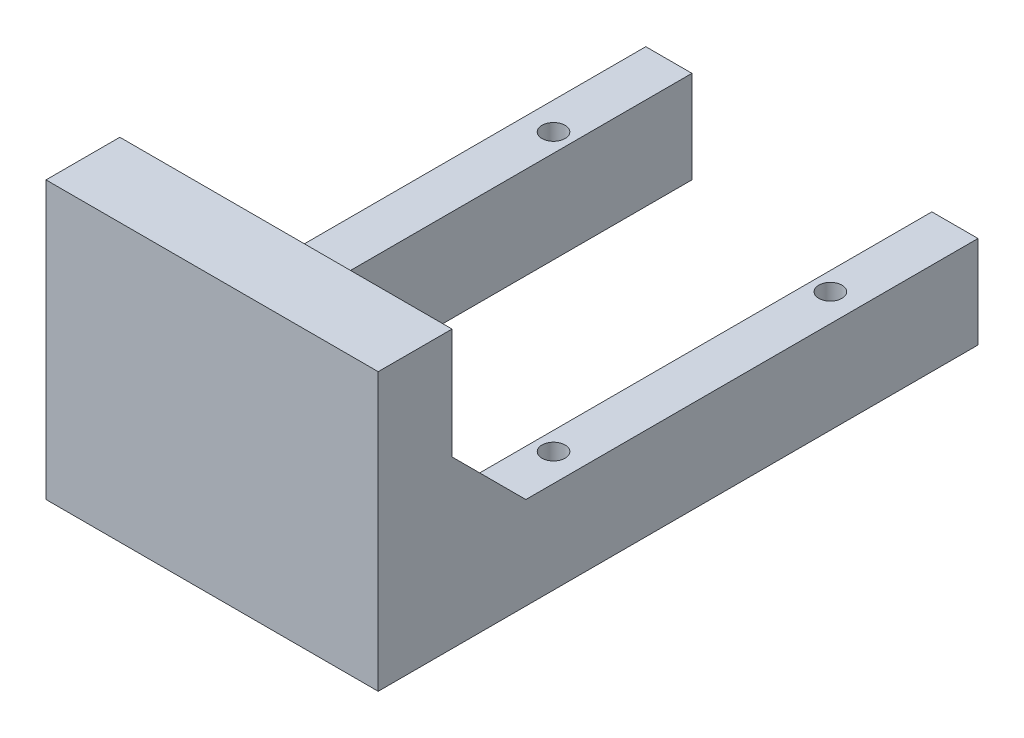
ISO-10303-21;
HEADER;
FILE_DESCRIPTION(('STEP AP214'),'2;1');
FILE_NAME('part.step','',(''),(''),'','','');
FILE_SCHEMA(('AUTOMOTIVE_DESIGN { 1 0 10303 214 1 1 1 1 }'));
ENDSEC;
DATA;
#1=APPLICATION_CONTEXT('core data for automotive mechanical design processes');
#2=APPLICATION_PROTOCOL_DEFINITION('international standard','automotive_design',2000,#1);
#3=PRODUCT_CONTEXT('',#1,'mechanical');
#4=PRODUCT('Part','Part','',(#3));
#5=PRODUCT_RELATED_PRODUCT_CATEGORY('part','',(#4));
#6=PRODUCT_DEFINITION_FORMATION('','',#4);
#7=PRODUCT_DEFINITION_CONTEXT('part definition',#1,'design');
#8=PRODUCT_DEFINITION('design','',#6,#7);
#9=PRODUCT_DEFINITION_SHAPE('','',#8);
#10=(LENGTH_UNIT() NAMED_UNIT(*) SI_UNIT(.MILLI.,.METRE.));
#11=(NAMED_UNIT(*) PLANE_ANGLE_UNIT() SI_UNIT($,.RADIAN.));
#12=(NAMED_UNIT(*) SI_UNIT($,.STERADIAN.) SOLID_ANGLE_UNIT());
#13=UNCERTAINTY_MEASURE_WITH_UNIT(LENGTH_MEASURE(1.E-05),#10,'distance_accuracy_value','');
#14=(GEOMETRIC_REPRESENTATION_CONTEXT(3) GLOBAL_UNCERTAINTY_ASSIGNED_CONTEXT((#13)) GLOBAL_UNIT_ASSIGNED_CONTEXT((#10,
#11,#12)) REPRESENTATION_CONTEXT('',''));
#15=CARTESIAN_POINT('',(0.,0.,0.));
#16=DIRECTION('',(0.,0.,1.));
#17=DIRECTION('',(1.,0.,0.));
#18=AXIS2_PLACEMENT_3D('',#15,#16,#17);
#19=CARTESIAN_POINT('',(0.,0.,0.));
#20=DIRECTION('',(0.,1.,0.));
#21=DIRECTION('',(0.,0.,1.));
#22=AXIS2_PLACEMENT_3D('',#19,#20,#21);
#23=PLANE('',#22);
#24=DIRECTION('',(0.,0.,1.));
#25=VECTOR('',#24,1.);
#26=CARTESIAN_POINT('',(26.,0.,124.));
#27=LINE('',#26,#25);
#28=CARTESIAN_POINT('',(26.,0.,124.));
#29=VERTEX_POINT('',#28);
#30=CARTESIAN_POINT('',(26.,0.,222.));
#31=VERTEX_POINT('',#30);
#32=EDGE_CURVE('E216',#29,#31,#27,.T.);
#33=ORIENTED_EDGE('',*,*,#32,.T.);
#34=DIRECTION('',(1.,0.,0.));
#35=VECTOR('',#34,1.);
#36=CARTESIAN_POINT('',(36.,0.,222.));
#37=LINE('',#36,#35);
#38=CARTESIAN_POINT('',(36.,0.,222.));
#39=VERTEX_POINT('',#38);
#40=EDGE_CURVE('E62',#31,#39,#37,.T.);
#41=ORIENTED_EDGE('',*,*,#40,.T.);
#42=DIRECTION('',(0.,0.,-1.));
#43=VECTOR('',#42,1.);
#44=CARTESIAN_POINT('',(36.,0.,254.));
#45=LINE('',#44,#43);
#46=CARTESIAN_POINT('',(36.,0.,124.));
#47=VERTEX_POINT('',#46);
#48=EDGE_CURVE('E189',#39,#47,#45,.T.);
#49=ORIENTED_EDGE('',*,*,#48,.T.);
#50=DIRECTION('',(-1.,0.,0.));
#51=VECTOR('',#50,1.);
#52=CARTESIAN_POINT('',(36.,0.,124.));
#53=LINE('',#52,#51);
#54=EDGE_CURVE('E213',#47,#29,#53,.T.);
#55=ORIENTED_EDGE('',*,*,#54,.T.);
#56=EDGE_LOOP('',(#33,#41,#49,#55));
#57=FACE_BOUND('',#56,.T.);
#58=CARTESIAN_POINT('',(30.,0.,210.));
#59=DIRECTION('',(0.,1.,0.));
#60=DIRECTION('',(0.,0.,1.));
#61=AXIS2_PLACEMENT_3D('',#58,#59,#60);
#62=CIRCLE('',#61,2.5);
#63=CARTESIAN_POINT('',(30.,0.,212.5));
#64=VERTEX_POINT('',#63);
#65=EDGE_CURVE('E173',#64,#64,#62,.T.);
#66=ORIENTED_EDGE('',*,*,#65,.F.);
#67=EDGE_LOOP('',(#66));
#68=FACE_BOUND('',#67,.T.);
#69=CARTESIAN_POINT('',(30.,0.,150.));
#70=DIRECTION('',(0.,1.,0.));
#71=DIRECTION('',(0.,0.,1.));
#72=AXIS2_PLACEMENT_3D('',#69,#70,#71);
#73=CIRCLE('',#72,2.5);
#74=CARTESIAN_POINT('',(30.,0.,152.5));
#75=VERTEX_POINT('',#74);
#76=EDGE_CURVE('E166',#75,#75,#73,.T.);
#77=ORIENTED_EDGE('',*,*,#76,.F.);
#78=EDGE_LOOP('',(#77));
#79=FACE_BOUND('',#78,.T.);
#80=ADVANCED_FACE('F41',(#57,#68,#79),#23,.T.);
#81=CARTESIAN_POINT('',(-36.,-20.,254.));
#82=DIRECTION('',(0.,0.,1.));
#83=DIRECTION('',(1.,0.,0.));
#84=AXIS2_PLACEMENT_3D('',#81,#82,#83);
#85=PLANE('',#84);
#86=DIRECTION('',(0.,1.,0.));
#87=VECTOR('',#86,1.);
#88=CARTESIAN_POINT('',(36.,-20.,254.));
#89=LINE('',#88,#87);
#90=CARTESIAN_POINT('',(36.,-20.,254.));
#91=VERTEX_POINT('',#90);
#92=CARTESIAN_POINT('',(36.,40.,254.));
#93=VERTEX_POINT('',#92);
#94=EDGE_CURVE('E147',#91,#93,#89,.T.);
#95=ORIENTED_EDGE('',*,*,#94,.T.);
#96=DIRECTION('',(1.,0.,0.));
#97=VECTOR('',#96,1.);
#98=CARTESIAN_POINT('',(-36.,40.,254.));
#99=LINE('',#98,#97);
#100=CARTESIAN_POINT('',(-36.,40.,254.));
#101=VERTEX_POINT('',#100);
#102=EDGE_CURVE('E145',#101,#93,#99,.T.);
#103=ORIENTED_EDGE('',*,*,#102,.F.);
#104=DIRECTION('',(0.,1.,0.));
#105=VECTOR('',#104,1.);
#106=CARTESIAN_POINT('',(-36.,-20.,254.));
#107=LINE('',#106,#105);
#108=CARTESIAN_POINT('',(-36.,-20.,254.));
#109=VERTEX_POINT('',#108);
#110=EDGE_CURVE('E129',#109,#101,#107,.T.);
#111=ORIENTED_EDGE('',*,*,#110,.F.);
#112=DIRECTION('',(1.,0.,0.));
#113=VECTOR('',#112,1.);
#114=CARTESIAN_POINT('',(-36.,-20.,254.));
#115=LINE('',#114,#113);
#116=EDGE_CURVE('E190',#109,#91,#115,.T.);
#117=ORIENTED_EDGE('',*,*,#116,.T.);
#118=EDGE_LOOP('',(#95,#103,#111,#117));
#119=FACE_BOUND('',#118,.T.);
#120=ADVANCED_FACE('F146',(#119),#85,.T.);
#121=CARTESIAN_POINT('',(-36.,-20.,254.));
#122=DIRECTION('',(-1.,0.,0.));
#123=DIRECTION('',(0.,0.,1.));
#124=AXIS2_PLACEMENT_3D('',#121,#122,#123);
#125=PLANE('',#124);
#126=DIRECTION('',(0.,0.,1.));
#127=VECTOR('',#126,1.);
#128=CARTESIAN_POINT('',(-36.,0.,254.));
#129=LINE('',#128,#127);
#130=CARTESIAN_POINT('',(-36.,0.,124.));
#131=VERTEX_POINT('',#130);
#132=CARTESIAN_POINT('',(-36.,0.,222.));
#133=VERTEX_POINT('',#132);
#134=EDGE_CURVE('E193',#131,#133,#129,.T.);
#135=ORIENTED_EDGE('',*,*,#134,.F.);
#136=DIRECTION('',(0.,1.,0.));
#137=VECTOR('',#136,1.);
#138=CARTESIAN_POINT('',(-36.,-20.,124.));
#139=LINE('',#138,#137);
#140=CARTESIAN_POINT('',(-36.,-20.,124.));
#141=VERTEX_POINT('',#140);
#142=EDGE_CURVE('E142',#141,#131,#139,.T.);
#143=ORIENTED_EDGE('',*,*,#142,.F.);
#144=DIRECTION('',(0.,0.,1.));
#145=VECTOR('',#144,1.);
#146=CARTESIAN_POINT('',(-36.,-20.,254.));
#147=LINE('',#146,#145);
#148=EDGE_CURVE('E137',#141,#109,#147,.T.);
#149=ORIENTED_EDGE('',*,*,#148,.T.);
#150=ORIENTED_EDGE('',*,*,#110,.T.);
#151=DIRECTION('',(0.,0.,1.));
#152=VECTOR('',#151,1.);
#153=CARTESIAN_POINT('',(-36.,40.,254.));
#154=LINE('',#153,#152);
#155=CARTESIAN_POINT('',(-36.,40.,238.));
#156=VERTEX_POINT('',#155);
#157=EDGE_CURVE('E135',#156,#101,#154,.T.);
#158=ORIENTED_EDGE('',*,*,#157,.F.);
#159=DIRECTION('',(0.,-1.,0.));
#160=VECTOR('',#159,1.);
#161=CARTESIAN_POINT('',(-36.,40.,238.));
#162=LINE('',#161,#160);
#163=CARTESIAN_POINT('',(-36.,16.0000000000001,238.));
#164=VERTEX_POINT('',#163);
#165=EDGE_CURVE('E160',#156,#164,#162,.T.);
#166=ORIENTED_EDGE('',*,*,#165,.T.);
#167=DIRECTION('',(0.,0.707106781186551,0.707106781186544));
#168=VECTOR('',#167,1.);
#169=CARTESIAN_POINT('',(-36.,16.0000000000001,238.));
#170=LINE('',#169,#168);
#171=EDGE_CURVE('E247',#164,#133,#170,.F.);
#172=ORIENTED_EDGE('',*,*,#171,.T.);
#173=EDGE_LOOP('',(#135,#143,#149,#150,#158,#166,#172));
#174=FACE_BOUND('',#173,.T.);
#175=ADVANCED_FACE('F132',(#174),#125,.T.);
#176=CARTESIAN_POINT('',(-36.,-20.,124.));
#177=DIRECTION('',(0.,0.,-1.));
#178=DIRECTION('',(-1.,0.,0.));
#179=AXIS2_PLACEMENT_3D('',#176,#177,#178);
#180=PLANE('',#179);
#181=DIRECTION('',(-1.,0.,0.));
#182=VECTOR('',#181,1.);
#183=CARTESIAN_POINT('',(-36.,0.,124.));
#184=LINE('',#183,#182);
#185=CARTESIAN_POINT('',(-26.,0.,124.));
#186=VERTEX_POINT('',#185);
#187=EDGE_CURVE('E220',#186,#131,#184,.T.);
#188=ORIENTED_EDGE('',*,*,#187,.F.);
#189=DIRECTION('',(0.,1.,0.));
#190=VECTOR('',#189,1.);
#191=CARTESIAN_POINT('',(-26.,-20.,124.));
#192=LINE('',#191,#190);
#193=CARTESIAN_POINT('',(-26.,-20.,124.));
#194=VERTEX_POINT('',#193);
#195=EDGE_CURVE('E226',#194,#186,#192,.T.);
#196=ORIENTED_EDGE('',*,*,#195,.F.);
#197=DIRECTION('',(-1.,0.,0.));
#198=VECTOR('',#197,1.);
#199=CARTESIAN_POINT('',(-36.,-20.,124.));
#200=LINE('',#199,#198);
#201=EDGE_CURVE('E208',#194,#141,#200,.T.);
#202=ORIENTED_EDGE('',*,*,#201,.T.);
#203=ORIENTED_EDGE('',*,*,#142,.T.);
#204=EDGE_LOOP('',(#188,#196,#202,#203));
#205=FACE_BOUND('',#204,.T.);
#206=ADVANCED_FACE('F267',(#205),#180,.T.);
#207=CARTESIAN_POINT('',(-26.,-20.,124.));
#208=DIRECTION('',(1.,0.,0.));
#209=DIRECTION('',(0.,0.,-1.));
#210=AXIS2_PLACEMENT_3D('',#207,#208,#209);
#211=PLANE('',#210);
#212=DIRECTION('',(0.,0.,-1.));
#213=VECTOR('',#212,1.);
#214=CARTESIAN_POINT('',(-26.,0.,124.));
#215=LINE('',#214,#213);
#216=CARTESIAN_POINT('',(-26.,0.,222.));
#217=VERTEX_POINT('',#216);
#218=EDGE_CURVE('E218',#217,#186,#215,.T.);
#219=ORIENTED_EDGE('',*,*,#218,.F.);
#220=DIRECTION('',(0.,-0.707106781186551,-0.707106781186544));
#221=VECTOR('',#220,1.);
#222=CARTESIAN_POINT('',(-25.9999999999999,16.0000000000001,238.));
#223=LINE('',#222,#221);
#224=CARTESIAN_POINT('',(-25.9999999999999,16.0000000000001,238.));
#225=VERTEX_POINT('',#224);
#226=EDGE_CURVE('E249',#217,#225,#223,.F.);
#227=ORIENTED_EDGE('',*,*,#226,.T.);
#228=DIRECTION('',(0.,1.,0.));
#229=VECTOR('',#228,1.);
#230=CARTESIAN_POINT('',(-25.9999999999999,-20.,238.));
#231=LINE('',#230,#229);
#232=CARTESIAN_POINT('',(-25.9999999999999,-20.,238.));
#233=VERTEX_POINT('',#232);
#234=EDGE_CURVE('E229',#233,#225,#231,.T.);
#235=ORIENTED_EDGE('',*,*,#234,.F.);
#236=DIRECTION('',(0.,0.,-1.));
#237=VECTOR('',#236,1.);
#238=CARTESIAN_POINT('',(-26.,-20.,124.));
#239=LINE('',#238,#237);
#240=EDGE_CURVE('E205',#233,#194,#239,.T.);
#241=ORIENTED_EDGE('',*,*,#240,.T.);
#242=ORIENTED_EDGE('',*,*,#195,.T.);
#243=EDGE_LOOP('',(#219,#227,#235,#241,#242));
#244=FACE_BOUND('',#243,.T.);
#245=ADVANCED_FACE('F255',(#244),#211,.T.);
#246=CARTESIAN_POINT('',(-25.9999999999999,-20.,238.));
#247=DIRECTION('',(0.,0.,-1.));
#248=DIRECTION('',(-1.,0.,0.));
#249=AXIS2_PLACEMENT_3D('',#246,#247,#248);
#250=PLANE('',#249);
#251=ORIENTED_EDGE('',*,*,#234,.T.);
#252=DIRECTION('',(-1.,0.,0.));
#253=VECTOR('',#252,1.);
#254=CARTESIAN_POINT('',(-36.,16.0000000000001,238.));
#255=LINE('',#254,#253);
#256=EDGE_CURVE('E241',#225,#164,#255,.T.);
#257=ORIENTED_EDGE('',*,*,#256,.T.);
#258=ORIENTED_EDGE('',*,*,#165,.F.);
#259=DIRECTION('',(-1.,0.,0.));
#260=VECTOR('',#259,1.);
#261=CARTESIAN_POINT('',(-36.,40.,238.));
#262=LINE('',#261,#260);
#263=CARTESIAN_POINT('',(36.,40.,238.));
#264=VERTEX_POINT('',#263);
#265=EDGE_CURVE('E154',#264,#156,#262,.T.);
#266=ORIENTED_EDGE('',*,*,#265,.F.);
#267=DIRECTION('',(0.,-1.,0.));
#268=VECTOR('',#267,1.);
#269=CARTESIAN_POINT('',(36.,40.,238.));
#270=LINE('',#269,#268);
#271=CARTESIAN_POINT('',(36.,16.0000000000001,238.));
#272=VERTEX_POINT('',#271);
#273=EDGE_CURVE('E162',#264,#272,#270,.T.);
#274=ORIENTED_EDGE('',*,*,#273,.T.);
#275=DIRECTION('',(-1.,0.,0.));
#276=VECTOR('',#275,1.);
#277=CARTESIAN_POINT('',(26.,16.0000000000001,238.));
#278=LINE('',#277,#276);
#279=CARTESIAN_POINT('',(26.,16.0000000000001,238.));
#280=VERTEX_POINT('',#279);
#281=EDGE_CURVE('E141',#272,#280,#278,.T.);
#282=ORIENTED_EDGE('',*,*,#281,.T.);
#283=DIRECTION('',(0.,1.,0.));
#284=VECTOR('',#283,1.);
#285=CARTESIAN_POINT('',(26.,-20.,238.));
#286=LINE('',#285,#284);
#287=CARTESIAN_POINT('',(26.,-20.,238.));
#288=VERTEX_POINT('',#287);
#289=EDGE_CURVE('E231',#288,#280,#286,.T.);
#290=ORIENTED_EDGE('',*,*,#289,.F.);
#291=DIRECTION('',(-1.,0.,0.));
#292=VECTOR('',#291,1.);
#293=CARTESIAN_POINT('',(-25.9999999999999,-20.,238.));
#294=LINE('',#293,#292);
#295=EDGE_CURVE('E202',#288,#233,#294,.T.);
#296=ORIENTED_EDGE('',*,*,#295,.T.);
#297=EDGE_LOOP('',(#251,#257,#258,#266,#274,#282,#290,#296));
#298=FACE_BOUND('',#297,.T.);
#299=ADVANCED_FACE('F261',(#298),#250,.T.);
#300=CARTESIAN_POINT('',(26.,-20.,124.));
#301=DIRECTION('',(-1.,0.,0.));
#302=DIRECTION('',(0.,0.,1.));
#303=AXIS2_PLACEMENT_3D('',#300,#301,#302);
#304=PLANE('',#303);
#305=ORIENTED_EDGE('',*,*,#32,.F.);
#306=DIRECTION('',(0.,1.,0.));
#307=VECTOR('',#306,1.);
#308=CARTESIAN_POINT('',(26.,-20.,124.));
#309=LINE('',#308,#307);
#310=CARTESIAN_POINT('',(26.,-20.,124.));
#311=VERTEX_POINT('',#310);
#312=EDGE_CURVE('E233',#311,#29,#309,.T.);
#313=ORIENTED_EDGE('',*,*,#312,.F.);
#314=DIRECTION('',(0.,0.,1.));
#315=VECTOR('',#314,1.);
#316=CARTESIAN_POINT('',(26.,-20.,124.));
#317=LINE('',#316,#315);
#318=EDGE_CURVE('E199',#311,#288,#317,.T.);
#319=ORIENTED_EDGE('',*,*,#318,.T.);
#320=ORIENTED_EDGE('',*,*,#289,.T.);
#321=DIRECTION('',(0.,0.707106781186551,0.707106781186544));
#322=VECTOR('',#321,1.);
#323=CARTESIAN_POINT('',(26.,16.0000000000001,238.));
#324=LINE('',#323,#322);
#325=EDGE_CURVE('E49',#280,#31,#324,.F.);
#326=ORIENTED_EDGE('',*,*,#325,.T.);
#327=EDGE_LOOP('',(#305,#313,#319,#320,#326));
#328=FACE_BOUND('',#327,.T.);
#329=ADVANCED_FACE('F383',(#328),#304,.T.);
#330=CARTESIAN_POINT('',(36.,-20.,124.));
#331=DIRECTION('',(0.,0.,-1.));
#332=DIRECTION('',(-1.,0.,0.));
#333=AXIS2_PLACEMENT_3D('',#330,#331,#332);
#334=PLANE('',#333);
#335=ORIENTED_EDGE('',*,*,#54,.F.);
#336=DIRECTION('',(0.,1.,0.));
#337=VECTOR('',#336,1.);
#338=CARTESIAN_POINT('',(36.,-20.,124.));
#339=LINE('',#338,#337);
#340=CARTESIAN_POINT('',(36.,-20.,124.));
#341=VERTEX_POINT('',#340);
#342=EDGE_CURVE('E235',#341,#47,#339,.T.);
#343=ORIENTED_EDGE('',*,*,#342,.F.);
#344=DIRECTION('',(-1.,0.,0.));
#345=VECTOR('',#344,1.);
#346=CARTESIAN_POINT('',(36.,-20.,124.));
#347=LINE('',#346,#345);
#348=EDGE_CURVE('E196',#341,#311,#347,.T.);
#349=ORIENTED_EDGE('',*,*,#348,.T.);
#350=ORIENTED_EDGE('',*,*,#312,.T.);
#351=EDGE_LOOP('',(#335,#343,#349,#350));
#352=FACE_BOUND('',#351,.T.);
#353=ADVANCED_FACE('F312',(#352),#334,.T.);
#354=CARTESIAN_POINT('',(36.,-20.,254.));
#355=DIRECTION('',(1.,0.,0.));
#356=DIRECTION('',(0.,0.,-1.));
#357=AXIS2_PLACEMENT_3D('',#354,#355,#356);
#358=PLANE('',#357);
#359=ORIENTED_EDGE('',*,*,#48,.F.);
#360=DIRECTION('',(0.,-0.707106781186551,-0.707106781186544));
#361=VECTOR('',#360,1.);
#362=CARTESIAN_POINT('',(36.,16.0000000000001,238.));
#363=LINE('',#362,#361);
#364=EDGE_CURVE('E11',#39,#272,#363,.F.);
#365=ORIENTED_EDGE('',*,*,#364,.T.);
#366=ORIENTED_EDGE('',*,*,#273,.F.);
#367=DIRECTION('',(0.,0.,-1.));
#368=VECTOR('',#367,1.);
#369=CARTESIAN_POINT('',(36.,40.,254.));
#370=LINE('',#369,#368);
#371=EDGE_CURVE('E150',#93,#264,#370,.T.);
#372=ORIENTED_EDGE('',*,*,#371,.F.);
#373=ORIENTED_EDGE('',*,*,#94,.F.);
#374=DIRECTION('',(0.,0.,-1.));
#375=VECTOR('',#374,1.);
#376=CARTESIAN_POINT('',(36.,-20.,254.));
#377=LINE('',#376,#375);
#378=EDGE_CURVE('E192',#91,#341,#377,.T.);
#379=ORIENTED_EDGE('',*,*,#378,.T.);
#380=ORIENTED_EDGE('',*,*,#342,.T.);
#381=EDGE_LOOP('',(#359,#365,#366,#372,#373,#379,#380));
#382=FACE_BOUND('',#381,.T.);
#383=ADVANCED_FACE('F275',(#382),#358,.T.);
#384=CARTESIAN_POINT('',(0.,-20.,0.));
#385=DIRECTION('',(0.,1.,0.));
#386=DIRECTION('',(0.,0.,1.));
#387=AXIS2_PLACEMENT_3D('',#384,#385,#386);
#388=PLANE('',#387);
#389=CARTESIAN_POINT('',(-30.,-20.,210.));
#390=DIRECTION('',(0.,1.,0.));
#391=DIRECTION('',(0.,0.,1.));
#392=AXIS2_PLACEMENT_3D('',#389,#390,#391);
#393=CIRCLE('',#392,2.5);
#394=CARTESIAN_POINT('',(-30.,-20.,212.5));
#395=VERTEX_POINT('',#394);
#396=EDGE_CURVE('E177',#395,#395,#393,.F.);
#397=ORIENTED_EDGE('',*,*,#396,.F.);
#398=EDGE_LOOP('',(#397));
#399=FACE_BOUND('',#398,.T.);
#400=CARTESIAN_POINT('',(-30.,-20.,150.));
#401=DIRECTION('',(0.,1.,0.));
#402=DIRECTION('',(0.,0.,1.));
#403=AXIS2_PLACEMENT_3D('',#400,#401,#402);
#404=CIRCLE('',#403,2.5);
#405=CARTESIAN_POINT('',(-30.,-20.,152.5));
#406=VERTEX_POINT('',#405);
#407=EDGE_CURVE('E170',#406,#406,#404,.F.);
#408=ORIENTED_EDGE('',*,*,#407,.F.);
#409=EDGE_LOOP('',(#408));
#410=FACE_BOUND('',#409,.T.);
#411=CARTESIAN_POINT('',(30.,-20.,150.));
#412=DIRECTION('',(0.,1.,0.));
#413=DIRECTION('',(0.,0.,1.));
#414=AXIS2_PLACEMENT_3D('',#411,#412,#413);
#415=CIRCLE('',#414,2.5);
#416=CARTESIAN_POINT('',(30.,-20.,152.5));
#417=VERTEX_POINT('',#416);
#418=EDGE_CURVE('E169',#417,#417,#415,.F.);
#419=ORIENTED_EDGE('',*,*,#418,.F.);
#420=EDGE_LOOP('',(#419));
#421=FACE_BOUND('',#420,.T.);
#422=CARTESIAN_POINT('',(30.,-20.,210.));
#423=DIRECTION('',(0.,1.,0.));
#424=DIRECTION('',(0.,0.,1.));
#425=AXIS2_PLACEMENT_3D('',#422,#423,#424);
#426=CIRCLE('',#425,2.5);
#427=CARTESIAN_POINT('',(30.,-20.,212.5));
#428=VERTEX_POINT('',#427);
#429=EDGE_CURVE('E186',#428,#428,#426,.F.);
#430=ORIENTED_EDGE('',*,*,#429,.F.);
#431=EDGE_LOOP('',(#430));
#432=FACE_BOUND('',#431,.T.);
#433=ORIENTED_EDGE('',*,*,#116,.F.);
#434=ORIENTED_EDGE('',*,*,#148,.F.);
#435=ORIENTED_EDGE('',*,*,#201,.F.);
#436=ORIENTED_EDGE('',*,*,#240,.F.);
#437=ORIENTED_EDGE('',*,*,#295,.F.);
#438=ORIENTED_EDGE('',*,*,#318,.F.);
#439=ORIENTED_EDGE('',*,*,#348,.F.);
#440=ORIENTED_EDGE('',*,*,#378,.F.);
#441=EDGE_LOOP('',(#433,#434,#435,#436,#437,#438,#439,#440));
#442=FACE_BOUND('',#441,.T.);
#443=ADVANCED_FACE('F270',(#399,#410,#421,#432,#442),#388,.F.);
#444=ORIENTED_EDGE('',*,*,#134,.T.);
#445=DIRECTION('',(1.,0.,0.));
#446=VECTOR('',#445,1.);
#447=CARTESIAN_POINT('',(-25.9999999999999,0.,222.));
#448=LINE('',#447,#446);
#449=EDGE_CURVE('E244',#133,#217,#448,.T.);
#450=ORIENTED_EDGE('',*,*,#449,.T.);
#451=ORIENTED_EDGE('',*,*,#218,.T.);
#452=ORIENTED_EDGE('',*,*,#187,.T.);
#453=EDGE_LOOP('',(#444,#450,#451,#452));
#454=FACE_BOUND('',#453,.T.);
#455=CARTESIAN_POINT('',(-30.,0.,210.));
#456=DIRECTION('',(0.,1.,0.));
#457=DIRECTION('',(0.,0.,1.));
#458=AXIS2_PLACEMENT_3D('',#455,#456,#457);
#459=CIRCLE('',#458,2.5);
#460=CARTESIAN_POINT('',(-30.,0.,212.5));
#461=VERTEX_POINT('',#460);
#462=EDGE_CURVE('E165',#461,#461,#459,.T.);
#463=ORIENTED_EDGE('',*,*,#462,.F.);
#464=EDGE_LOOP('',(#463));
#465=FACE_BOUND('',#464,.T.);
#466=CARTESIAN_POINT('',(-30.,0.,150.));
#467=DIRECTION('',(0.,1.,0.));
#468=DIRECTION('',(0.,0.,1.));
#469=AXIS2_PLACEMENT_3D('',#466,#467,#468);
#470=CIRCLE('',#469,2.5);
#471=CARTESIAN_POINT('',(-30.,0.,152.5));
#472=VERTEX_POINT('',#471);
#473=EDGE_CURVE('E174',#472,#472,#470,.T.);
#474=ORIENTED_EDGE('',*,*,#473,.F.);
#475=EDGE_LOOP('',(#474));
#476=FACE_BOUND('',#475,.T.);
#477=ADVANCED_FACE('F263',(#454,#465,#476),#23,.T.);
#478=CARTESIAN_POINT('',(30.,-24.5209785294237,210.));
#479=DIRECTION('',(0.,1.,0.));
#480=DIRECTION('',(0.,0.,1.));
#481=AXIS2_PLACEMENT_3D('',#478,#479,#480);
#482=CYLINDRICAL_SURFACE('',#481,2.5);
#483=ORIENTED_EDGE('',*,*,#65,.T.);
#484=EDGE_LOOP('',(#483));
#485=FACE_BOUND('',#484,.T.);
#486=ORIENTED_EDGE('',*,*,#429,.T.);
#487=EDGE_LOOP('',(#486));
#488=FACE_BOUND('',#487,.T.);
#489=ADVANCED_FACE('F298',(#485,#488),#482,.F.);
#490=CARTESIAN_POINT('',(30.,-24.5209785294237,150.));
#491=DIRECTION('',(0.,1.,0.));
#492=DIRECTION('',(0.,0.,1.));
#493=AXIS2_PLACEMENT_3D('',#490,#491,#492);
#494=CYLINDRICAL_SURFACE('',#493,2.5);
#495=ORIENTED_EDGE('',*,*,#76,.T.);
#496=EDGE_LOOP('',(#495));
#497=FACE_BOUND('',#496,.T.);
#498=ORIENTED_EDGE('',*,*,#418,.T.);
#499=EDGE_LOOP('',(#498));
#500=FACE_BOUND('',#499,.T.);
#501=ADVANCED_FACE('F304',(#497,#500),#494,.F.);
#502=CARTESIAN_POINT('',(-30.,-24.5209785294237,150.));
#503=DIRECTION('',(0.,1.,0.));
#504=DIRECTION('',(0.,0.,1.));
#505=AXIS2_PLACEMENT_3D('',#502,#503,#504);
#506=CYLINDRICAL_SURFACE('',#505,2.5);
#507=ORIENTED_EDGE('',*,*,#473,.T.);
#508=EDGE_LOOP('',(#507));
#509=FACE_BOUND('',#508,.T.);
#510=ORIENTED_EDGE('',*,*,#407,.T.);
#511=EDGE_LOOP('',(#510));
#512=FACE_BOUND('',#511,.T.);
#513=ADVANCED_FACE('F320',(#509,#512),#506,.F.);
#514=CARTESIAN_POINT('',(-30.,-24.5209785294237,210.));
#515=DIRECTION('',(0.,1.,0.));
#516=DIRECTION('',(0.,0.,1.));
#517=AXIS2_PLACEMENT_3D('',#514,#515,#516);
#518=CYLINDRICAL_SURFACE('',#517,2.5);
#519=ORIENTED_EDGE('',*,*,#462,.T.);
#520=EDGE_LOOP('',(#519));
#521=FACE_BOUND('',#520,.T.);
#522=ORIENTED_EDGE('',*,*,#396,.T.);
#523=EDGE_LOOP('',(#522));
#524=FACE_BOUND('',#523,.T.);
#525=ADVANCED_FACE('F317',(#521,#524),#518,.F.);
#526=CARTESIAN_POINT('',(0.,40.,0.));
#527=DIRECTION('',(0.,-1.,0.));
#528=DIRECTION('',(0.,0.,-1.));
#529=AXIS2_PLACEMENT_3D('',#526,#527,#528);
#530=PLANE('',#529);
#531=ORIENTED_EDGE('',*,*,#157,.T.);
#532=ORIENTED_EDGE('',*,*,#102,.T.);
#533=ORIENTED_EDGE('',*,*,#371,.T.);
#534=ORIENTED_EDGE('',*,*,#265,.T.);
#535=EDGE_LOOP('',(#531,#532,#533,#534));
#536=FACE_BOUND('',#535,.T.);
#537=ADVANCED_FACE('F152',(#536),#530,.F.);
#538=CARTESIAN_POINT('',(-25.9999999999999,16.0000000000001,238.));
#539=DIRECTION('',(0.,0.707106781186544,-0.707106781186551));
#540=DIRECTION('',(1.,0.,0.));
#541=AXIS2_PLACEMENT_3D('',#538,#539,#540);
#542=PLANE('',#541);
#543=ORIENTED_EDGE('',*,*,#226,.F.);
#544=ORIENTED_EDGE('',*,*,#449,.F.);
#545=ORIENTED_EDGE('',*,*,#171,.F.);
#546=ORIENTED_EDGE('',*,*,#256,.F.);
#547=EDGE_LOOP('',(#543,#544,#545,#546));
#548=FACE_BOUND('',#547,.T.);
#549=ADVANCED_FACE('F259',(#548),#542,.T.);
#550=CARTESIAN_POINT('',(-25.9999999999999,16.0000000000001,238.));
#551=DIRECTION('',(0.,0.707106781186544,-0.707106781186551));
#552=DIRECTION('',(1.,0.,0.));
#553=AXIS2_PLACEMENT_3D('',#550,#551,#552);
#554=PLANE('',#553);
#555=ORIENTED_EDGE('',*,*,#364,.F.);
#556=ORIENTED_EDGE('',*,*,#40,.F.);
#557=ORIENTED_EDGE('',*,*,#325,.F.);
#558=ORIENTED_EDGE('',*,*,#281,.F.);
#559=EDGE_LOOP('',(#555,#556,#557,#558));
#560=FACE_BOUND('',#559,.T.);
#561=ADVANCED_FACE('F43',(#560),#554,.T.);
#562=CLOSED_SHELL('',(#80,#120,#175,#206,#245,#299,#329,#353,#383,#443,#477,#489,#501,#513,#525,
#537,#549,#561));
#563=MANIFOLD_SOLID_BREP('B2',#562);
#564=ADVANCED_BREP_SHAPE_REPRESENTATION('',(#18,#563),#14);
#565=SHAPE_DEFINITION_REPRESENTATION(#9,#564);
ENDSEC;
END-ISO-10303-21;
